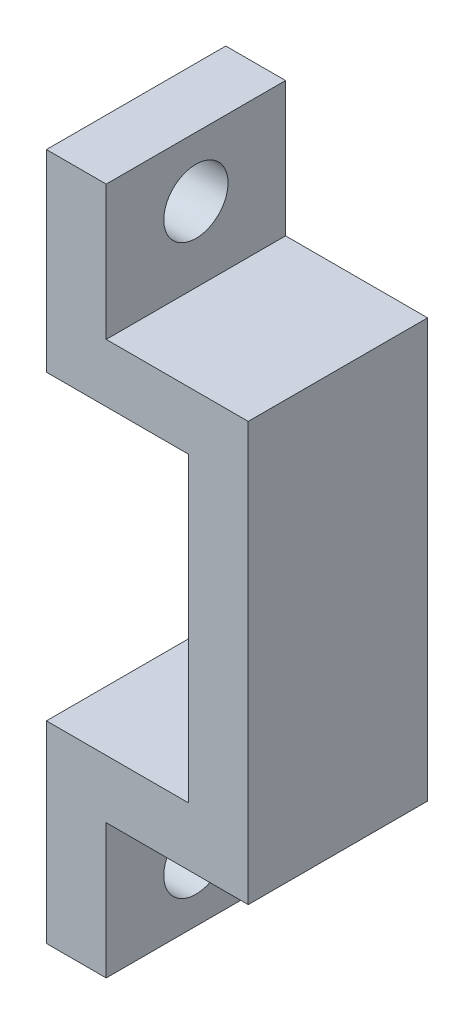
ISO-10303-21;
HEADER;
FILE_DESCRIPTION(('STEP AP214'),'2;1');
FILE_NAME('part.step','',(''),(''),'','','');
FILE_SCHEMA(('AUTOMOTIVE_DESIGN { 1 0 10303 214 1 1 1 1 }'));
ENDSEC;
DATA;
#1=APPLICATION_CONTEXT('core data for automotive mechanical design processes');
#2=APPLICATION_PROTOCOL_DEFINITION('international standard','automotive_design',2000,#1);
#3=PRODUCT_CONTEXT('',#1,'mechanical');
#4=PRODUCT('Part','Part','',(#3));
#5=PRODUCT_RELATED_PRODUCT_CATEGORY('part','',(#4));
#6=PRODUCT_DEFINITION_FORMATION('','',#4);
#7=PRODUCT_DEFINITION_CONTEXT('part definition',#1,'design');
#8=PRODUCT_DEFINITION('design','',#6,#7);
#9=PRODUCT_DEFINITION_SHAPE('','',#8);
#10=(LENGTH_UNIT() NAMED_UNIT(*) SI_UNIT(.MILLI.,.METRE.));
#11=(NAMED_UNIT(*) PLANE_ANGLE_UNIT() SI_UNIT($,.RADIAN.));
#12=(NAMED_UNIT(*) SI_UNIT($,.STERADIAN.) SOLID_ANGLE_UNIT());
#13=UNCERTAINTY_MEASURE_WITH_UNIT(LENGTH_MEASURE(1.E-05),#10,'distance_accuracy_value','');
#14=(GEOMETRIC_REPRESENTATION_CONTEXT(3) GLOBAL_UNCERTAINTY_ASSIGNED_CONTEXT((#13)) GLOBAL_UNIT_ASSIGNED_CONTEXT((#10,
#11,#12)) REPRESENTATION_CONTEXT('',''));
#15=CARTESIAN_POINT('',(0.,0.,0.));
#16=DIRECTION('',(0.,0.,1.));
#17=DIRECTION('',(1.,0.,0.));
#18=AXIS2_PLACEMENT_3D('',#15,#16,#17);
#19=CARTESIAN_POINT('',(86.5000000000012,84.6677030305753,-12.));
#20=DIRECTION('',(0.,1.,0.));
#21=DIRECTION('',(0.,0.,1.));
#22=AXIS2_PLACEMENT_3D('',#19,#20,#21);
#23=PLANE('',#22);
#24=DIRECTION('',(-1.,0.,0.));
#25=VECTOR('',#24,1.);
#26=CARTESIAN_POINT('',(86.5000000000012,84.6677030305753,0.));
#27=LINE('',#26,#25);
#28=CARTESIAN_POINT('',(86.5000000000012,84.6677030305753,0.));
#29=VERTEX_POINT('',#28);
#30=CARTESIAN_POINT('',(82.5000000000012,84.6677030305753,0.));
#31=VERTEX_POINT('',#30);
#32=EDGE_CURVE('E157',#29,#31,#27,.T.);
#33=ORIENTED_EDGE('',*,*,#32,.F.);
#34=DIRECTION('',(0.,0.,1.));
#35=VECTOR('',#34,1.);
#36=CARTESIAN_POINT('',(86.5000000000012,84.6677030305753,-12.));
#37=LINE('',#36,#35);
#38=CARTESIAN_POINT('',(86.5000000000012,84.6677030305753,-12.));
#39=VERTEX_POINT('',#38);
#40=EDGE_CURVE('E11',#39,#29,#37,.T.);
#41=ORIENTED_EDGE('',*,*,#40,.F.);
#42=DIRECTION('',(-1.,0.,0.));
#43=VECTOR('',#42,1.);
#44=CARTESIAN_POINT('',(86.5000000000012,84.6677030305753,-12.));
#45=LINE('',#44,#43);
#46=CARTESIAN_POINT('',(82.5000000000012,84.6677030305753,-12.));
#47=VERTEX_POINT('',#46);
#48=EDGE_CURVE('E189',#39,#47,#45,.T.);
#49=ORIENTED_EDGE('',*,*,#48,.T.);
#50=DIRECTION('',(0.,0.,1.));
#51=VECTOR('',#50,1.);
#52=CARTESIAN_POINT('',(82.5000000000012,84.6677030305753,-12.));
#53=LINE('',#52,#51);
#54=EDGE_CURVE('E103',#47,#31,#53,.T.);
#55=ORIENTED_EDGE('',*,*,#54,.T.);
#56=EDGE_LOOP('',(#33,#41,#49,#55));
#57=FACE_BOUND('',#56,.T.);
#58=ADVANCED_FACE('F35',(#57),#23,.T.);
#59=CARTESIAN_POINT('',(86.5000000000012,75.6677030305753,-12.));
#60=DIRECTION('',(1.,0.,0.));
#61=DIRECTION('',(0.,0.,-1.));
#62=AXIS2_PLACEMENT_3D('',#59,#60,#61);
#63=PLANE('',#62);
#64=CARTESIAN_POINT('',(86.5000000000012,80.6677030305753,-5.99999999999995));
#65=DIRECTION('',(1.,0.,0.));
#66=DIRECTION('',(0.,0.,-1.));
#67=AXIS2_PLACEMENT_3D('',#64,#65,#66);
#68=CIRCLE('',#67,2.14999999999999);
#69=CARTESIAN_POINT('',(86.5000000000012,80.6677030305753,-8.14999999999993));
#70=VERTEX_POINT('',#69);
#71=EDGE_CURVE('E214',#70,#70,#68,.T.);
#72=ORIENTED_EDGE('',*,*,#71,.F.);
#73=EDGE_LOOP('',(#72));
#74=FACE_BOUND('',#73,.T.);
#75=DIRECTION('',(0.,1.,0.));
#76=VECTOR('',#75,1.);
#77=CARTESIAN_POINT('',(86.5000000000012,75.6677030305753,0.));
#78=LINE('',#77,#76);
#79=CARTESIAN_POINT('',(86.5000000000012,75.6677030305753,0.));
#80=VERTEX_POINT('',#79);
#81=EDGE_CURVE('E187',#80,#29,#78,.T.);
#82=ORIENTED_EDGE('',*,*,#81,.F.);
#83=DIRECTION('',(0.,0.,1.));
#84=VECTOR('',#83,1.);
#85=CARTESIAN_POINT('',(86.5000000000012,75.6677030305753,-12.));
#86=LINE('',#85,#84);
#87=CARTESIAN_POINT('',(86.5000000000012,75.6677030305753,-12.));
#88=VERTEX_POINT('',#87);
#89=EDGE_CURVE('E44',#88,#80,#86,.T.);
#90=ORIENTED_EDGE('',*,*,#89,.F.);
#91=DIRECTION('',(0.,1.,0.));
#92=VECTOR('',#91,1.);
#93=CARTESIAN_POINT('',(86.5000000000012,75.6677030305753,-12.));
#94=LINE('',#93,#92);
#95=EDGE_CURVE('E147',#88,#39,#94,.T.);
#96=ORIENTED_EDGE('',*,*,#95,.T.);
#97=ORIENTED_EDGE('',*,*,#40,.T.);
#98=EDGE_LOOP('',(#82,#90,#96,#97));
#99=FACE_BOUND('',#98,.T.);
#100=ADVANCED_FACE('F267',(#74,#99),#63,.T.);
#101=CARTESIAN_POINT('',(96.0000000000012,75.6677030305753,-12.));
#102=DIRECTION('',(0.,1.,0.));
#103=DIRECTION('',(0.,0.,1.));
#104=AXIS2_PLACEMENT_3D('',#101,#102,#103);
#105=PLANE('',#104);
#106=DIRECTION('',(-1.,0.,0.));
#107=VECTOR('',#106,1.);
#108=CARTESIAN_POINT('',(96.0000000000012,75.6677030305753,0.));
#109=LINE('',#108,#107);
#110=CARTESIAN_POINT('',(96.0000000000012,75.6677030305753,0.));
#111=VERTEX_POINT('',#110);
#112=EDGE_CURVE('E134',#111,#80,#109,.T.);
#113=ORIENTED_EDGE('',*,*,#112,.F.);
#114=DIRECTION('',(0.,0.,1.));
#115=VECTOR('',#114,1.);
#116=CARTESIAN_POINT('',(96.0000000000012,75.6677030305753,-12.));
#117=LINE('',#116,#115);
#118=CARTESIAN_POINT('',(96.0000000000012,75.6677030305753,-12.));
#119=VERTEX_POINT('',#118);
#120=EDGE_CURVE('E129',#119,#111,#117,.T.);
#121=ORIENTED_EDGE('',*,*,#120,.F.);
#122=DIRECTION('',(-1.,0.,0.));
#123=VECTOR('',#122,1.);
#124=CARTESIAN_POINT('',(96.0000000000012,75.6677030305753,-12.));
#125=LINE('',#124,#123);
#126=EDGE_CURVE('E132',#119,#88,#125,.T.);
#127=ORIENTED_EDGE('',*,*,#126,.T.);
#128=ORIENTED_EDGE('',*,*,#89,.T.);
#129=EDGE_LOOP('',(#113,#121,#127,#128));
#130=FACE_BOUND('',#129,.T.);
#131=ADVANCED_FACE('F131',(#130),#105,.T.);
#132=CARTESIAN_POINT('',(96.0000000000012,47.6677030305753,-12.));
#133=DIRECTION('',(1.,0.,0.));
#134=DIRECTION('',(0.,0.,-1.));
#135=AXIS2_PLACEMENT_3D('',#132,#133,#134);
#136=PLANE('',#135);
#137=DIRECTION('',(0.,1.,0.));
#138=VECTOR('',#137,1.);
#139=CARTESIAN_POINT('',(96.0000000000012,47.6677030305753,0.));
#140=LINE('',#139,#138);
#141=CARTESIAN_POINT('',(96.0000000000012,47.6677030305753,0.));
#142=VERTEX_POINT('',#141);
#143=EDGE_CURVE('E184',#142,#111,#140,.T.);
#144=ORIENTED_EDGE('',*,*,#143,.F.);
#145=DIRECTION('',(0.,0.,1.));
#146=VECTOR('',#145,1.);
#147=CARTESIAN_POINT('',(96.0000000000012,47.6677030305753,-12.));
#148=LINE('',#147,#146);
#149=CARTESIAN_POINT('',(96.0000000000012,47.6677030305753,-12.));
#150=VERTEX_POINT('',#149);
#151=EDGE_CURVE('E139',#150,#142,#148,.T.);
#152=ORIENTED_EDGE('',*,*,#151,.F.);
#153=DIRECTION('',(0.,1.,0.));
#154=VECTOR('',#153,1.);
#155=CARTESIAN_POINT('',(96.0000000000012,47.6677030305753,-12.));
#156=LINE('',#155,#154);
#157=EDGE_CURVE('E145',#150,#119,#156,.T.);
#158=ORIENTED_EDGE('',*,*,#157,.T.);
#159=ORIENTED_EDGE('',*,*,#120,.T.);
#160=EDGE_LOOP('',(#144,#152,#158,#159));
#161=FACE_BOUND('',#160,.T.);
#162=ADVANCED_FACE('F149',(#161),#136,.T.);
#163=CARTESIAN_POINT('',(86.5000000000012,47.6677030305753,-12.));
#164=DIRECTION('',(0.,-1.,0.));
#165=DIRECTION('',(0.,0.,-1.));
#166=AXIS2_PLACEMENT_3D('',#163,#164,#165);
#167=PLANE('',#166);
#168=DIRECTION('',(1.,0.,0.));
#169=VECTOR('',#168,1.);
#170=CARTESIAN_POINT('',(86.5000000000012,47.6677030305753,0.));
#171=LINE('',#170,#169);
#172=CARTESIAN_POINT('',(86.5000000000012,47.6677030305753,0.));
#173=VERTEX_POINT('',#172);
#174=EDGE_CURVE('E181',#173,#142,#171,.T.);
#175=ORIENTED_EDGE('',*,*,#174,.F.);
#176=DIRECTION('',(0.,0.,1.));
#177=VECTOR('',#176,1.);
#178=CARTESIAN_POINT('',(86.5000000000012,47.6677030305753,-12.));
#179=LINE('',#178,#177);
#180=CARTESIAN_POINT('',(86.5000000000012,47.6677030305753,-12.));
#181=VERTEX_POINT('',#180);
#182=EDGE_CURVE('E193',#181,#173,#179,.T.);
#183=ORIENTED_EDGE('',*,*,#182,.F.);
#184=DIRECTION('',(1.,0.,0.));
#185=VECTOR('',#184,1.);
#186=CARTESIAN_POINT('',(86.5000000000012,47.6677030305753,-12.));
#187=LINE('',#186,#185);
#188=EDGE_CURVE('E150',#181,#150,#187,.T.);
#189=ORIENTED_EDGE('',*,*,#188,.T.);
#190=ORIENTED_EDGE('',*,*,#151,.T.);
#191=EDGE_LOOP('',(#175,#183,#189,#190));
#192=FACE_BOUND('',#191,.T.);
#193=ADVANCED_FACE('F282',(#192),#167,.T.);
#194=CARTESIAN_POINT('',(86.5000000000012,38.6677030305753,-12.));
#195=DIRECTION('',(1.,0.,0.));
#196=DIRECTION('',(0.,0.,-1.));
#197=AXIS2_PLACEMENT_3D('',#194,#195,#196);
#198=PLANE('',#197);
#199=CARTESIAN_POINT('',(86.5000000000012,42.6677030305753,-5.99999999999995));
#200=DIRECTION('',(1.,0.,0.));
#201=DIRECTION('',(0.,0.,-1.));
#202=AXIS2_PLACEMENT_3D('',#199,#200,#201);
#203=CIRCLE('',#202,2.14999999999999);
#204=CARTESIAN_POINT('',(86.5000000000012,42.6677030305753,-8.14999999999993));
#205=VERTEX_POINT('',#204);
#206=EDGE_CURVE('E209',#205,#205,#203,.T.);
#207=ORIENTED_EDGE('',*,*,#206,.F.);
#208=EDGE_LOOP('',(#207));
#209=FACE_BOUND('',#208,.T.);
#210=DIRECTION('',(0.,1.,0.));
#211=VECTOR('',#210,1.);
#212=CARTESIAN_POINT('',(86.5000000000012,38.6677030305753,0.));
#213=LINE('',#212,#211);
#214=CARTESIAN_POINT('',(86.5000000000012,38.6677030305753,0.));
#215=VERTEX_POINT('',#214);
#216=EDGE_CURVE('E178',#215,#173,#213,.T.);
#217=ORIENTED_EDGE('',*,*,#216,.F.);
#218=DIRECTION('',(0.,0.,1.));
#219=VECTOR('',#218,1.);
#220=CARTESIAN_POINT('',(86.5000000000012,38.6677030305753,-12.));
#221=LINE('',#220,#219);
#222=CARTESIAN_POINT('',(86.5000000000012,38.6677030305753,-12.));
#223=VERTEX_POINT('',#222);
#224=EDGE_CURVE('E195',#223,#215,#221,.T.);
#225=ORIENTED_EDGE('',*,*,#224,.F.);
#226=DIRECTION('',(0.,1.,0.));
#227=VECTOR('',#226,1.);
#228=CARTESIAN_POINT('',(86.5000000000012,38.6677030305753,-12.));
#229=LINE('',#228,#227);
#230=EDGE_CURVE('E152',#223,#181,#229,.T.);
#231=ORIENTED_EDGE('',*,*,#230,.T.);
#232=ORIENTED_EDGE('',*,*,#182,.T.);
#233=EDGE_LOOP('',(#217,#225,#231,#232));
#234=FACE_BOUND('',#233,.T.);
#235=ADVANCED_FACE('F242',(#209,#234),#198,.T.);
#236=CARTESIAN_POINT('',(82.5000000000012,38.6677030305753,-12.));
#237=DIRECTION('',(0.,-1.,0.));
#238=DIRECTION('',(0.,0.,-1.));
#239=AXIS2_PLACEMENT_3D('',#236,#237,#238);
#240=PLANE('',#239);
#241=DIRECTION('',(1.,0.,0.));
#242=VECTOR('',#241,1.);
#243=CARTESIAN_POINT('',(82.5000000000012,38.6677030305753,0.));
#244=LINE('',#243,#242);
#245=CARTESIAN_POINT('',(82.5000000000012,38.6677030305753,0.));
#246=VERTEX_POINT('',#245);
#247=EDGE_CURVE('E175',#246,#215,#244,.T.);
#248=ORIENTED_EDGE('',*,*,#247,.F.);
#249=DIRECTION('',(0.,0.,1.));
#250=VECTOR('',#249,1.);
#251=CARTESIAN_POINT('',(82.5000000000012,38.6677030305753,-12.));
#252=LINE('',#251,#250);
#253=CARTESIAN_POINT('',(82.5000000000012,38.6677030305753,-12.));
#254=VERTEX_POINT('',#253);
#255=EDGE_CURVE('E197',#254,#246,#252,.T.);
#256=ORIENTED_EDGE('',*,*,#255,.F.);
#257=DIRECTION('',(1.,0.,0.));
#258=VECTOR('',#257,1.);
#259=CARTESIAN_POINT('',(82.5000000000012,38.6677030305753,-12.));
#260=LINE('',#259,#258);
#261=EDGE_CURVE('E236',#254,#223,#260,.T.);
#262=ORIENTED_EDGE('',*,*,#261,.T.);
#263=ORIENTED_EDGE('',*,*,#224,.T.);
#264=EDGE_LOOP('',(#248,#256,#262,#263));
#265=FACE_BOUND('',#264,.T.);
#266=ADVANCED_FACE('F248',(#265),#240,.T.);
#267=CARTESIAN_POINT('',(82.5000000000012,51.5677030305753,-12.));
#268=DIRECTION('',(-1.,0.,0.));
#269=DIRECTION('',(0.,-1.,0.));
#270=AXIS2_PLACEMENT_3D('',#267,#268,#269);
#271=PLANE('',#270);
#272=CARTESIAN_POINT('',(82.5000000000012,42.6677030305753,-5.99999999999995));
#273=DIRECTION('',(-1.,0.,0.));
#274=DIRECTION('',(0.,-1.,0.));
#275=AXIS2_PLACEMENT_3D('',#272,#273,#274);
#276=CIRCLE('',#275,2.14999999999999);
#277=CARTESIAN_POINT('',(82.5000000000012,40.5177030305753,-5.99999999999995));
#278=VERTEX_POINT('',#277);
#279=EDGE_CURVE('E38',#278,#278,#276,.T.);
#280=ORIENTED_EDGE('',*,*,#279,.F.);
#281=EDGE_LOOP('',(#280));
#282=FACE_BOUND('',#281,.T.);
#283=DIRECTION('',(0.,-1.,0.));
#284=VECTOR('',#283,1.);
#285=CARTESIAN_POINT('',(82.5000000000012,51.5677030305753,0.));
#286=LINE('',#285,#284);
#287=CARTESIAN_POINT('',(82.5000000000012,51.5677030305753,0.));
#288=VERTEX_POINT('',#287);
#289=EDGE_CURVE('E172',#288,#246,#286,.T.);
#290=ORIENTED_EDGE('',*,*,#289,.F.);
#291=DIRECTION('',(0.,0.,1.));
#292=VECTOR('',#291,1.);
#293=CARTESIAN_POINT('',(82.5000000000012,51.5677030305753,-12.));
#294=LINE('',#293,#292);
#295=CARTESIAN_POINT('',(82.5000000000012,51.5677030305753,-12.));
#296=VERTEX_POINT('',#295);
#297=EDGE_CURVE('E199',#296,#288,#294,.T.);
#298=ORIENTED_EDGE('',*,*,#297,.F.);
#299=DIRECTION('',(0.,-1.,0.));
#300=VECTOR('',#299,1.);
#301=CARTESIAN_POINT('',(82.5000000000012,51.5677030305753,-12.));
#302=LINE('',#301,#300);
#303=EDGE_CURVE('E233',#296,#254,#302,.T.);
#304=ORIENTED_EDGE('',*,*,#303,.T.);
#305=ORIENTED_EDGE('',*,*,#255,.T.);
#306=EDGE_LOOP('',(#290,#298,#304,#305));
#307=FACE_BOUND('',#306,.T.);
#308=ADVANCED_FACE('F251',(#282,#307),#271,.T.);
#309=CARTESIAN_POINT('',(92.0000000000012,51.5677030305753,-12.));
#310=DIRECTION('',(0.,1.,0.));
#311=DIRECTION('',(0.,0.,1.));
#312=AXIS2_PLACEMENT_3D('',#309,#310,#311);
#313=PLANE('',#312);
#314=DIRECTION('',(-1.,0.,0.));
#315=VECTOR('',#314,1.);
#316=CARTESIAN_POINT('',(92.0000000000012,51.5677030305753,0.));
#317=LINE('',#316,#315);
#318=CARTESIAN_POINT('',(92.0000000000012,51.5677030305753,0.));
#319=VERTEX_POINT('',#318);
#320=EDGE_CURVE('E169',#319,#288,#317,.T.);
#321=ORIENTED_EDGE('',*,*,#320,.F.);
#322=DIRECTION('',(0.,0.,1.));
#323=VECTOR('',#322,1.);
#324=CARTESIAN_POINT('',(92.0000000000012,51.5677030305753,-12.));
#325=LINE('',#324,#323);
#326=CARTESIAN_POINT('',(92.0000000000012,51.5677030305753,-12.));
#327=VERTEX_POINT('',#326);
#328=EDGE_CURVE('E201',#327,#319,#325,.T.);
#329=ORIENTED_EDGE('',*,*,#328,.F.);
#330=DIRECTION('',(-1.,0.,0.));
#331=VECTOR('',#330,1.);
#332=CARTESIAN_POINT('',(92.0000000000012,51.5677030305753,-12.));
#333=LINE('',#332,#331);
#334=EDGE_CURVE('E230',#327,#296,#333,.T.);
#335=ORIENTED_EDGE('',*,*,#334,.T.);
#336=ORIENTED_EDGE('',*,*,#297,.T.);
#337=EDGE_LOOP('',(#321,#329,#335,#336));
#338=FACE_BOUND('',#337,.T.);
#339=ADVANCED_FACE('F256',(#338),#313,.T.);
#340=CARTESIAN_POINT('',(92.0000000000012,71.7677030305753,-12.));
#341=DIRECTION('',(-1.,0.,0.));
#342=DIRECTION('',(0.,0.,1.));
#343=AXIS2_PLACEMENT_3D('',#340,#341,#342);
#344=PLANE('',#343);
#345=DIRECTION('',(0.,-1.,0.));
#346=VECTOR('',#345,1.);
#347=CARTESIAN_POINT('',(92.0000000000012,71.7677030305753,0.));
#348=LINE('',#347,#346);
#349=CARTESIAN_POINT('',(92.0000000000012,71.7677030305753,0.));
#350=VERTEX_POINT('',#349);
#351=EDGE_CURVE('E166',#350,#319,#348,.T.);
#352=ORIENTED_EDGE('',*,*,#351,.F.);
#353=DIRECTION('',(0.,0.,1.));
#354=VECTOR('',#353,1.);
#355=CARTESIAN_POINT('',(92.0000000000012,71.7677030305753,-12.));
#356=LINE('',#355,#354);
#357=CARTESIAN_POINT('',(92.0000000000012,71.7677030305753,-12.));
#358=VERTEX_POINT('',#357);
#359=EDGE_CURVE('E203',#358,#350,#356,.T.);
#360=ORIENTED_EDGE('',*,*,#359,.F.);
#361=DIRECTION('',(0.,-1.,0.));
#362=VECTOR('',#361,1.);
#363=CARTESIAN_POINT('',(92.0000000000012,71.7677030305753,-12.));
#364=LINE('',#363,#362);
#365=EDGE_CURVE('E227',#358,#327,#364,.T.);
#366=ORIENTED_EDGE('',*,*,#365,.T.);
#367=ORIENTED_EDGE('',*,*,#328,.T.);
#368=EDGE_LOOP('',(#352,#360,#366,#367));
#369=FACE_BOUND('',#368,.T.);
#370=ADVANCED_FACE('F259',(#369),#344,.T.);
#371=CARTESIAN_POINT('',(82.5000000000012,71.7677030305753,-12.));
#372=DIRECTION('',(0.,-1.,0.));
#373=DIRECTION('',(0.,0.,-1.));
#374=AXIS2_PLACEMENT_3D('',#371,#372,#373);
#375=PLANE('',#374);
#376=DIRECTION('',(1.,0.,0.));
#377=VECTOR('',#376,1.);
#378=CARTESIAN_POINT('',(82.5000000000012,71.7677030305753,0.));
#379=LINE('',#378,#377);
#380=CARTESIAN_POINT('',(82.5000000000012,71.7677030305753,0.));
#381=VERTEX_POINT('',#380);
#382=EDGE_CURVE('E163',#381,#350,#379,.T.);
#383=ORIENTED_EDGE('',*,*,#382,.F.);
#384=DIRECTION('',(0.,0.,1.));
#385=VECTOR('',#384,1.);
#386=CARTESIAN_POINT('',(82.5000000000012,71.7677030305753,-12.));
#387=LINE('',#386,#385);
#388=CARTESIAN_POINT('',(82.5000000000012,71.7677030305753,-12.));
#389=VERTEX_POINT('',#388);
#390=EDGE_CURVE('E205',#389,#381,#387,.T.);
#391=ORIENTED_EDGE('',*,*,#390,.F.);
#392=DIRECTION('',(1.,0.,0.));
#393=VECTOR('',#392,1.);
#394=CARTESIAN_POINT('',(82.5000000000012,71.7677030305753,-12.));
#395=LINE('',#394,#393);
#396=EDGE_CURVE('E224',#389,#358,#395,.T.);
#397=ORIENTED_EDGE('',*,*,#396,.T.);
#398=ORIENTED_EDGE('',*,*,#359,.T.);
#399=EDGE_LOOP('',(#383,#391,#397,#398));
#400=FACE_BOUND('',#399,.T.);
#401=ADVANCED_FACE('F263',(#400),#375,.T.);
#402=CARTESIAN_POINT('',(82.5000000000012,84.6677030305753,-12.));
#403=DIRECTION('',(-1.,0.,0.));
#404=DIRECTION('',(0.,0.,1.));
#405=AXIS2_PLACEMENT_3D('',#402,#403,#404);
#406=PLANE('',#405);
#407=CARTESIAN_POINT('',(82.5000000000012,80.6677030305753,-5.99999999999995));
#408=DIRECTION('',(-1.,0.,0.));
#409=DIRECTION('',(0.,0.,1.));
#410=AXIS2_PLACEMENT_3D('',#407,#408,#409);
#411=CIRCLE('',#410,2.14999999999999);
#412=CARTESIAN_POINT('',(82.5000000000012,80.6677030305753,-3.84999999999996));
#413=VERTEX_POINT('',#412);
#414=EDGE_CURVE('E207',#413,#413,#411,.T.);
#415=ORIENTED_EDGE('',*,*,#414,.F.);
#416=EDGE_LOOP('',(#415));
#417=FACE_BOUND('',#416,.T.);
#418=DIRECTION('',(0.,-1.,0.));
#419=VECTOR('',#418,1.);
#420=CARTESIAN_POINT('',(82.5000000000012,84.6677030305753,0.));
#421=LINE('',#420,#419);
#422=EDGE_CURVE('E160',#31,#381,#421,.T.);
#423=ORIENTED_EDGE('',*,*,#422,.F.);
#424=ORIENTED_EDGE('',*,*,#54,.F.);
#425=DIRECTION('',(0.,-1.,0.));
#426=VECTOR('',#425,1.);
#427=CARTESIAN_POINT('',(82.5000000000012,84.6677030305753,-12.));
#428=LINE('',#427,#426);
#429=EDGE_CURVE('E222',#47,#389,#428,.T.);
#430=ORIENTED_EDGE('',*,*,#429,.T.);
#431=ORIENTED_EDGE('',*,*,#390,.T.);
#432=EDGE_LOOP('',(#423,#424,#430,#431));
#433=FACE_BOUND('',#432,.T.);
#434=ADVANCED_FACE('F264',(#417,#433),#406,.T.);
#435=CARTESIAN_POINT('',(0.,0.,-12.));
#436=DIRECTION('',(0.,0.,1.));
#437=DIRECTION('',(1.,0.,0.));
#438=AXIS2_PLACEMENT_3D('',#435,#436,#437);
#439=PLANE('',#438);
#440=ORIENTED_EDGE('',*,*,#48,.F.);
#441=ORIENTED_EDGE('',*,*,#95,.F.);
#442=ORIENTED_EDGE('',*,*,#126,.F.);
#443=ORIENTED_EDGE('',*,*,#157,.F.);
#444=ORIENTED_EDGE('',*,*,#188,.F.);
#445=ORIENTED_EDGE('',*,*,#230,.F.);
#446=ORIENTED_EDGE('',*,*,#261,.F.);
#447=ORIENTED_EDGE('',*,*,#303,.F.);
#448=ORIENTED_EDGE('',*,*,#334,.F.);
#449=ORIENTED_EDGE('',*,*,#365,.F.);
#450=ORIENTED_EDGE('',*,*,#396,.F.);
#451=ORIENTED_EDGE('',*,*,#429,.F.);
#452=EDGE_LOOP('',(#440,#441,#442,#443,#444,#445,#446,#447,#448,#449,#450,#451));
#453=FACE_BOUND('',#452,.T.);
#454=ADVANCED_FACE('F143',(#453),#439,.F.);
#455=CARTESIAN_POINT('',(0.,0.,0.));
#456=DIRECTION('',(0.,0.,1.));
#457=DIRECTION('',(1.,0.,0.));
#458=AXIS2_PLACEMENT_3D('',#455,#456,#457);
#459=PLANE('',#458);
#460=ORIENTED_EDGE('',*,*,#32,.T.);
#461=ORIENTED_EDGE('',*,*,#422,.T.);
#462=ORIENTED_EDGE('',*,*,#382,.T.);
#463=ORIENTED_EDGE('',*,*,#351,.T.);
#464=ORIENTED_EDGE('',*,*,#320,.T.);
#465=ORIENTED_EDGE('',*,*,#289,.T.);
#466=ORIENTED_EDGE('',*,*,#247,.T.);
#467=ORIENTED_EDGE('',*,*,#216,.T.);
#468=ORIENTED_EDGE('',*,*,#174,.T.);
#469=ORIENTED_EDGE('',*,*,#143,.T.);
#470=ORIENTED_EDGE('',*,*,#112,.T.);
#471=ORIENTED_EDGE('',*,*,#81,.T.);
#472=EDGE_LOOP('',(#460,#461,#462,#463,#464,#465,#466,#467,#468,#469,#470,#471));
#473=FACE_BOUND('',#472,.T.);
#474=ADVANCED_FACE('F266',(#473),#459,.T.);
#475=CARTESIAN_POINT('',(47.5000000000012,80.6677030305753,-5.99999999999995));
#476=DIRECTION('',(1.,0.,0.));
#477=DIRECTION('',(0.,0.,-1.));
#478=AXIS2_PLACEMENT_3D('',#475,#476,#477);
#479=CYLINDRICAL_SURFACE('',#478,2.14999999999999);
#480=ORIENTED_EDGE('',*,*,#414,.T.);
#481=EDGE_LOOP('',(#480));
#482=FACE_BOUND('',#481,.T.);
#483=ORIENTED_EDGE('',*,*,#71,.T.);
#484=EDGE_LOOP('',(#483));
#485=FACE_BOUND('',#484,.T.);
#486=ADVANCED_FACE('F307',(#482,#485),#479,.F.);
#487=CARTESIAN_POINT('',(47.5000000000012,42.6677030305753,-5.99999999999995));
#488=DIRECTION('',(1.,0.,0.));
#489=DIRECTION('',(0.,0.,-1.));
#490=AXIS2_PLACEMENT_3D('',#487,#488,#489);
#491=CYLINDRICAL_SURFACE('',#490,2.14999999999999);
#492=ORIENTED_EDGE('',*,*,#279,.T.);
#493=EDGE_LOOP('',(#492));
#494=FACE_BOUND('',#493,.T.);
#495=ORIENTED_EDGE('',*,*,#206,.T.);
#496=EDGE_LOOP('',(#495));
#497=FACE_BOUND('',#496,.T.);
#498=ADVANCED_FACE('F311',(#494,#497),#491,.F.);
#499=CLOSED_SHELL('',(#58,#100,#131,#162,#193,#235,#266,#308,#339,#370,#401,#434,#454,#474,#486,#498));
#500=MANIFOLD_SOLID_BREP('B2',#499);
#501=ADVANCED_BREP_SHAPE_REPRESENTATION('',(#18,#500),#14);
#502=SHAPE_DEFINITION_REPRESENTATION(#9,#501);
ENDSEC;
END-ISO-10303-21;
